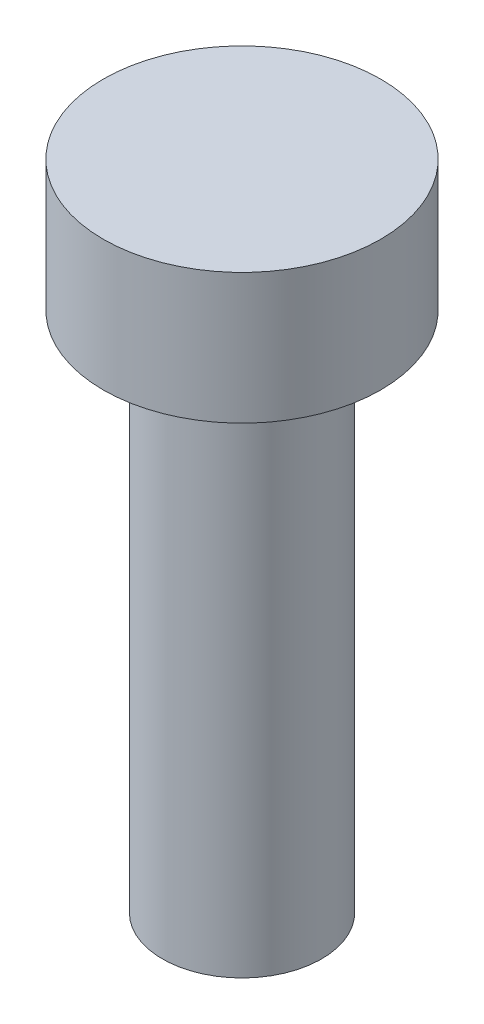
ISO-10303-21;
HEADER;
FILE_DESCRIPTION(('STEP AP214'),'2;1');
FILE_NAME('part.step','',(''),(''),'','','');
FILE_SCHEMA(('AUTOMOTIVE_DESIGN { 1 0 10303 214 1 1 1 1 }'));
ENDSEC;
DATA;
#1=APPLICATION_CONTEXT('core data for automotive mechanical design processes');
#2=APPLICATION_PROTOCOL_DEFINITION('international standard','automotive_design',2000,#1);
#3=PRODUCT_CONTEXT('',#1,'mechanical');
#4=PRODUCT('Part','Part','',(#3));
#5=PRODUCT_RELATED_PRODUCT_CATEGORY('part','',(#4));
#6=PRODUCT_DEFINITION_FORMATION('','',#4);
#7=PRODUCT_DEFINITION_CONTEXT('part definition',#1,'design');
#8=PRODUCT_DEFINITION('design','',#6,#7);
#9=PRODUCT_DEFINITION_SHAPE('','',#8);
#10=(LENGTH_UNIT() NAMED_UNIT(*) SI_UNIT(.MILLI.,.METRE.));
#11=(NAMED_UNIT(*) PLANE_ANGLE_UNIT() SI_UNIT($,.RADIAN.));
#12=(NAMED_UNIT(*) SI_UNIT($,.STERADIAN.) SOLID_ANGLE_UNIT());
#13=UNCERTAINTY_MEASURE_WITH_UNIT(LENGTH_MEASURE(1.E-05),#10,'distance_accuracy_value','');
#14=(GEOMETRIC_REPRESENTATION_CONTEXT(3) GLOBAL_UNCERTAINTY_ASSIGNED_CONTEXT((#13)) GLOBAL_UNIT_ASSIGNED_CONTEXT((#10,
#11,#12)) REPRESENTATION_CONTEXT('',''));
#15=CARTESIAN_POINT('',(0.,0.,0.));
#16=DIRECTION('',(0.,0.,1.));
#17=DIRECTION('',(1.,0.,0.));
#18=AXIS2_PLACEMENT_3D('',#15,#16,#17);
#19=CARTESIAN_POINT('',(0.,4.,0.));
#20=DIRECTION('',(0.,-1.,0.));
#21=DIRECTION('',(0.,0.,-1.));
#22=AXIS2_PLACEMENT_3D('',#19,#20,#21);
#23=CYLINDRICAL_SURFACE('',#22,4.25);
#24=CARTESIAN_POINT('',(0.,4.,0.));
#25=DIRECTION('',(0.,1.,0.));
#26=DIRECTION('',(0.,0.,1.));
#27=AXIS2_PLACEMENT_3D('',#24,#25,#26);
#28=CIRCLE('',#27,4.25);
#29=CARTESIAN_POINT('',(0.,4.,4.25));
#30=VERTEX_POINT('',#29);
#31=EDGE_CURVE('E38',#30,#30,#28,.T.);
#32=ORIENTED_EDGE('',*,*,#31,.F.);
#33=EDGE_LOOP('',(#32));
#34=FACE_BOUND('',#33,.T.);
#35=CARTESIAN_POINT('',(0.,0.,0.));
#36=DIRECTION('',(0.,1.,0.));
#37=DIRECTION('',(0.,0.,1.));
#38=AXIS2_PLACEMENT_3D('',#35,#36,#37);
#39=CIRCLE('',#38,4.25);
#40=CARTESIAN_POINT('',(0.,0.,4.25));
#41=VERTEX_POINT('',#40);
#42=EDGE_CURVE('E34',#41,#41,#39,.T.);
#43=ORIENTED_EDGE('',*,*,#42,.T.);
#44=EDGE_LOOP('',(#43));
#45=FACE_BOUND('',#44,.T.);
#46=ADVANCED_FACE('F31',(#34,#45),#23,.T.);
#47=CARTESIAN_POINT('',(0.,4.,0.));
#48=DIRECTION('',(0.,1.,0.));
#49=DIRECTION('',(0.,0.,1.));
#50=AXIS2_PLACEMENT_3D('',#47,#48,#49);
#51=PLANE('',#50);
#52=ORIENTED_EDGE('',*,*,#31,.T.);
#53=EDGE_LOOP('',(#52));
#54=FACE_BOUND('',#53,.T.);
#55=ADVANCED_FACE('F55',(#54),#51,.T.);
#56=CARTESIAN_POINT('',(0.,0.,0.));
#57=DIRECTION('',(0.,1.,0.));
#58=DIRECTION('',(0.,0.,1.));
#59=AXIS2_PLACEMENT_3D('',#56,#57,#58);
#60=PLANE('',#59);
#61=CARTESIAN_POINT('',(0.,0.,0.));
#62=DIRECTION('',(0.,-1.,0.));
#63=DIRECTION('',(0.,0.,-1.));
#64=AXIS2_PLACEMENT_3D('',#61,#62,#63);
#65=CIRCLE('',#64,2.44);
#66=CARTESIAN_POINT('',(0.,0.,-2.44));
#67=VERTEX_POINT('',#66);
#68=EDGE_CURVE('E10',#67,#67,#65,.T.);
#69=ORIENTED_EDGE('',*,*,#68,.F.);
#70=EDGE_LOOP('',(#69));
#71=FACE_BOUND('',#70,.T.);
#72=ORIENTED_EDGE('',*,*,#42,.F.);
#73=EDGE_LOOP('',(#72));
#74=FACE_BOUND('',#73,.T.);
#75=ADVANCED_FACE('F52',(#71,#74),#60,.F.);
#76=CARTESIAN_POINT('',(0.,-16.,0.));
#77=DIRECTION('',(0.,1.,0.));
#78=DIRECTION('',(0.,0.,1.));
#79=AXIS2_PLACEMENT_3D('',#76,#77,#78);
#80=CYLINDRICAL_SURFACE('',#79,2.44);
#81=CARTESIAN_POINT('',(0.,-16.,0.));
#82=DIRECTION('',(0.,-1.,0.));
#83=DIRECTION('',(0.,0.,-1.));
#84=AXIS2_PLACEMENT_3D('',#81,#82,#83);
#85=CIRCLE('',#84,2.44);
#86=CARTESIAN_POINT('',(0.,-16.,-2.44));
#87=VERTEX_POINT('',#86);
#88=EDGE_CURVE('E44',#87,#87,#85,.T.);
#89=ORIENTED_EDGE('',*,*,#88,.F.);
#90=EDGE_LOOP('',(#89));
#91=FACE_BOUND('',#90,.T.);
#92=ORIENTED_EDGE('',*,*,#68,.T.);
#93=EDGE_LOOP('',(#92));
#94=FACE_BOUND('',#93,.T.);
#95=ADVANCED_FACE('F54',(#91,#94),#80,.T.);
#96=CARTESIAN_POINT('',(0.,-16.,0.));
#97=DIRECTION('',(0.,-1.,0.));
#98=DIRECTION('',(0.,0.,-1.));
#99=AXIS2_PLACEMENT_3D('',#96,#97,#98);
#100=PLANE('',#99);
#101=ORIENTED_EDGE('',*,*,#88,.T.);
#102=EDGE_LOOP('',(#101));
#103=FACE_BOUND('',#102,.T.);
#104=ADVANCED_FACE('F61',(#103),#100,.T.);
#105=CLOSED_SHELL('',(#46,#55,#75,#95,#104));
#106=MANIFOLD_SOLID_BREP('B2',#105);
#107=ADVANCED_BREP_SHAPE_REPRESENTATION('',(#18,#106),#14);
#108=SHAPE_DEFINITION_REPRESENTATION(#9,#107);
ENDSEC;
END-ISO-10303-21;
